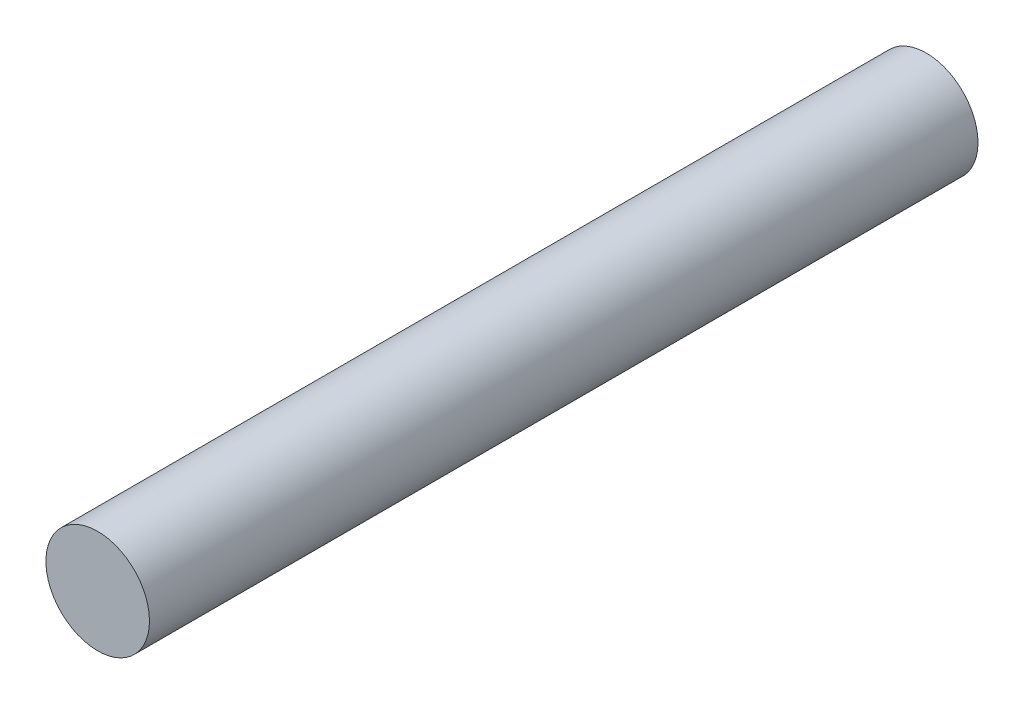
ISO-10303-21;
HEADER;
FILE_DESCRIPTION(('STEP AP214'),'2;1');
FILE_NAME('part.step','',(''),(''),'','','');
FILE_SCHEMA(('AUTOMOTIVE_DESIGN { 1 0 10303 214 1 1 1 1 }'));
ENDSEC;
DATA;
#1=APPLICATION_CONTEXT('core data for automotive mechanical design processes');
#2=APPLICATION_PROTOCOL_DEFINITION('international standard','automotive_design',2000,#1);
#3=PRODUCT_CONTEXT('',#1,'mechanical');
#4=PRODUCT('Part','Part','',(#3));
#5=PRODUCT_RELATED_PRODUCT_CATEGORY('part','',(#4));
#6=PRODUCT_DEFINITION_FORMATION('','',#4);
#7=PRODUCT_DEFINITION_CONTEXT('part definition',#1,'design');
#8=PRODUCT_DEFINITION('design','',#6,#7);
#9=PRODUCT_DEFINITION_SHAPE('','',#8);
#10=(LENGTH_UNIT() NAMED_UNIT(*) SI_UNIT(.MILLI.,.METRE.));
#11=(NAMED_UNIT(*) PLANE_ANGLE_UNIT() SI_UNIT($,.RADIAN.));
#12=(NAMED_UNIT(*) SI_UNIT($,.STERADIAN.) SOLID_ANGLE_UNIT());
#13=UNCERTAINTY_MEASURE_WITH_UNIT(LENGTH_MEASURE(1.E-05),#10,'distance_accuracy_value','');
#14=(GEOMETRIC_REPRESENTATION_CONTEXT(3) GLOBAL_UNCERTAINTY_ASSIGNED_CONTEXT((#13)) GLOBAL_UNIT_ASSIGNED_CONTEXT((#10,
#11,#12)) REPRESENTATION_CONTEXT('',''));
#15=CARTESIAN_POINT('',(0.,0.,0.));
#16=DIRECTION('',(0.,0.,1.));
#17=DIRECTION('',(1.,0.,0.));
#18=AXIS2_PLACEMENT_3D('',#15,#16,#17);
#19=CARTESIAN_POINT('',(0.,0.,-40.));
#20=DIRECTION('',(0.,0.,1.));
#21=DIRECTION('',(-1.,0.,0.));
#22=AXIS2_PLACEMENT_3D('',#19,#20,#21);
#23=CYLINDRICAL_SURFACE('',#22,2.5);
#24=CARTESIAN_POINT('',(0.,0.,-40.));
#25=DIRECTION('',(0.,0.,1.));
#26=DIRECTION('',(1.,0.,0.));
#27=AXIS2_PLACEMENT_3D('',#24,#25,#26);
#28=CIRCLE('',#27,2.5);
#29=CARTESIAN_POINT('',(2.5,0.,-40.));
#30=VERTEX_POINT('',#29);
#31=EDGE_CURVE('E10',#30,#30,#28,.T.);
#32=ORIENTED_EDGE('',*,*,#31,.T.);
#33=EDGE_LOOP('',(#32));
#34=FACE_BOUND('',#33,.T.);
#35=CARTESIAN_POINT('',(0.,0.,0.));
#36=DIRECTION('',(0.,0.,1.));
#37=DIRECTION('',(1.,0.,0.));
#38=AXIS2_PLACEMENT_3D('',#35,#36,#37);
#39=CIRCLE('',#38,2.5);
#40=CARTESIAN_POINT('',(2.5,0.,0.));
#41=VERTEX_POINT('',#40);
#42=EDGE_CURVE('E36',#41,#41,#39,.T.);
#43=ORIENTED_EDGE('',*,*,#42,.F.);
#44=EDGE_LOOP('',(#43));
#45=FACE_BOUND('',#44,.T.);
#46=ADVANCED_FACE('F33',(#34,#45),#23,.T.);
#47=CARTESIAN_POINT('',(0.,0.,-40.));
#48=DIRECTION('',(0.,0.,-1.));
#49=DIRECTION('',(1.,0.,0.));
#50=AXIS2_PLACEMENT_3D('',#47,#48,#49);
#51=PLANE('',#50);
#52=ORIENTED_EDGE('',*,*,#31,.F.);
#53=EDGE_LOOP('',(#52));
#54=FACE_BOUND('',#53,.T.);
#55=ADVANCED_FACE('F48',(#54),#51,.T.);
#56=CARTESIAN_POINT('',(0.,0.,0.));
#57=DIRECTION('',(0.,0.,-1.));
#58=DIRECTION('',(1.,0.,0.));
#59=AXIS2_PLACEMENT_3D('',#56,#57,#58);
#60=PLANE('',#59);
#61=ORIENTED_EDGE('',*,*,#42,.T.);
#62=EDGE_LOOP('',(#61));
#63=FACE_BOUND('',#62,.T.);
#64=ADVANCED_FACE('F45',(#63),#60,.F.);
#65=CLOSED_SHELL('',(#46,#55,#64));
#66=MANIFOLD_SOLID_BREP('B2',#65);
#67=ADVANCED_BREP_SHAPE_REPRESENTATION('',(#18,#66),#14);
#68=SHAPE_DEFINITION_REPRESENTATION(#9,#67);
ENDSEC;
END-ISO-10303-21;
